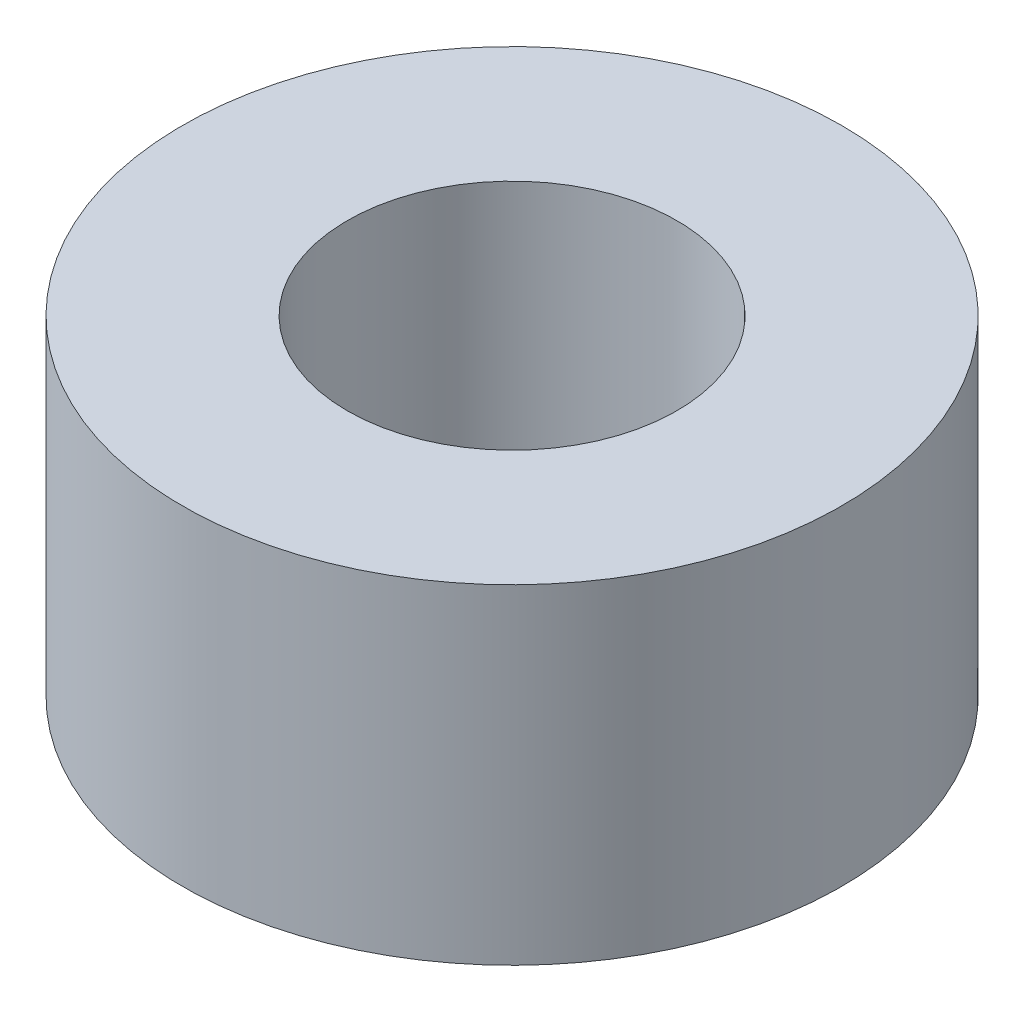
ISO-10303-21;
HEADER;
FILE_DESCRIPTION(('STEP AP214'),'2;1');
FILE_NAME('part.step','',(''),(''),'','','');
FILE_SCHEMA(('AUTOMOTIVE_DESIGN { 1 0 10303 214 1 1 1 1 }'));
ENDSEC;
DATA;
#1=APPLICATION_CONTEXT('core data for automotive mechanical design processes');
#2=APPLICATION_PROTOCOL_DEFINITION('international standard','automotive_design',2000,#1);
#3=PRODUCT_CONTEXT('',#1,'mechanical');
#4=PRODUCT('Part','Part','',(#3));
#5=PRODUCT_RELATED_PRODUCT_CATEGORY('part','',(#4));
#6=PRODUCT_DEFINITION_FORMATION('','',#4);
#7=PRODUCT_DEFINITION_CONTEXT('part definition',#1,'design');
#8=PRODUCT_DEFINITION('design','',#6,#7);
#9=PRODUCT_DEFINITION_SHAPE('','',#8);
#10=(LENGTH_UNIT() NAMED_UNIT(*) SI_UNIT(.MILLI.,.METRE.));
#11=(NAMED_UNIT(*) PLANE_ANGLE_UNIT() SI_UNIT($,.RADIAN.));
#12=(NAMED_UNIT(*) SI_UNIT($,.STERADIAN.) SOLID_ANGLE_UNIT());
#13=UNCERTAINTY_MEASURE_WITH_UNIT(LENGTH_MEASURE(1.E-05),#10,'distance_accuracy_value','');
#14=(GEOMETRIC_REPRESENTATION_CONTEXT(3) GLOBAL_UNCERTAINTY_ASSIGNED_CONTEXT((#13)) GLOBAL_UNIT_ASSIGNED_CONTEXT((#10,
#11,#12)) REPRESENTATION_CONTEXT('',''));
#15=CARTESIAN_POINT('',(0.,0.,0.));
#16=DIRECTION('',(0.,0.,1.));
#17=DIRECTION('',(1.,0.,0.));
#18=AXIS2_PLACEMENT_3D('',#15,#16,#17);
#19=CARTESIAN_POINT('',(32.,-44.175,0.));
#20=DIRECTION('',(0.,1.,0.));
#21=DIRECTION('',(0.,0.,1.));
#22=AXIS2_PLACEMENT_3D('',#19,#20,#21);
#23=CYLINDRICAL_SURFACE('',#22,1.5875);
#24=CARTESIAN_POINT('',(32.,-44.175,0.));
#25=DIRECTION('',(0.,1.,0.));
#26=DIRECTION('',(0.,0.,1.));
#27=AXIS2_PLACEMENT_3D('',#24,#25,#26);
#28=CIRCLE('',#27,1.5875);
#29=CARTESIAN_POINT('',(32.,-44.175,1.5875));
#30=VERTEX_POINT('',#29);
#31=EDGE_CURVE('E23',#30,#30,#28,.T.);
#32=ORIENTED_EDGE('',*,*,#31,.F.);
#33=EDGE_LOOP('',(#32));
#34=FACE_BOUND('',#33,.T.);
#35=CARTESIAN_POINT('',(32.,-41.,0.));
#36=DIRECTION('',(0.,1.,0.));
#37=DIRECTION('',(0.,0.,1.));
#38=AXIS2_PLACEMENT_3D('',#35,#36,#37);
#39=CIRCLE('',#38,1.5875);
#40=CARTESIAN_POINT('',(32.,-41.,1.5875));
#41=VERTEX_POINT('',#40);
#42=EDGE_CURVE('E34',#41,#41,#39,.T.);
#43=ORIENTED_EDGE('',*,*,#42,.T.);
#44=EDGE_LOOP('',(#43));
#45=FACE_BOUND('',#44,.T.);
#46=ADVANCED_FACE('F15',(#34,#45),#23,.F.);
#47=CARTESIAN_POINT('',(32.,-44.175,0.));
#48=DIRECTION('',(0.,1.,0.));
#49=DIRECTION('',(0.,0.,1.));
#50=AXIS2_PLACEMENT_3D('',#47,#48,#49);
#51=CYLINDRICAL_SURFACE('',#50,3.175);
#52=CARTESIAN_POINT('',(32.,-44.175,0.));
#53=DIRECTION('',(0.,-1.,0.));
#54=DIRECTION('',(0.,0.,-1.));
#55=AXIS2_PLACEMENT_3D('',#52,#53,#54);
#56=CIRCLE('',#55,3.175);
#57=CARTESIAN_POINT('',(32.,-44.175,-3.175));
#58=VERTEX_POINT('',#57);
#59=EDGE_CURVE('E10',#58,#58,#56,.T.);
#60=ORIENTED_EDGE('',*,*,#59,.F.);
#61=EDGE_LOOP('',(#60));
#62=FACE_BOUND('',#61,.T.);
#63=CARTESIAN_POINT('',(32.,-41.,0.));
#64=DIRECTION('',(0.,-1.,0.));
#65=DIRECTION('',(0.,0.,-1.));
#66=AXIS2_PLACEMENT_3D('',#63,#64,#65);
#67=CIRCLE('',#66,3.175);
#68=CARTESIAN_POINT('',(32.,-41.,-3.175));
#69=VERTEX_POINT('',#68);
#70=EDGE_CURVE('E18',#69,#69,#67,.T.);
#71=ORIENTED_EDGE('',*,*,#70,.T.);
#72=EDGE_LOOP('',(#71));
#73=FACE_BOUND('',#72,.T.);
#74=ADVANCED_FACE('F44',(#62,#73),#51,.T.);
#75=CARTESIAN_POINT('',(16.,-44.175,0.));
#76=DIRECTION('',(0.,1.,0.));
#77=DIRECTION('',(-1.,0.,0.));
#78=AXIS2_PLACEMENT_3D('',#75,#76,#77);
#79=PLANE('',#78);
#80=ORIENTED_EDGE('',*,*,#31,.T.);
#81=EDGE_LOOP('',(#80));
#82=FACE_BOUND('',#81,.T.);
#83=ORIENTED_EDGE('',*,*,#59,.T.);
#84=EDGE_LOOP('',(#83));
#85=FACE_BOUND('',#84,.T.);
#86=ADVANCED_FACE('F48',(#82,#85),#79,.F.);
#87=CARTESIAN_POINT('',(16.,-41.,0.));
#88=DIRECTION('',(0.,1.,0.));
#89=DIRECTION('',(-1.,0.,0.));
#90=AXIS2_PLACEMENT_3D('',#87,#88,#89);
#91=PLANE('',#90);
#92=ORIENTED_EDGE('',*,*,#42,.F.);
#93=EDGE_LOOP('',(#92));
#94=FACE_BOUND('',#93,.T.);
#95=ORIENTED_EDGE('',*,*,#70,.F.);
#96=EDGE_LOOP('',(#95));
#97=FACE_BOUND('',#96,.T.);
#98=ADVANCED_FACE('F46',(#94,#97),#91,.T.);
#99=CLOSED_SHELL('',(#46,#74,#86,#98));
#100=MANIFOLD_SOLID_BREP('B1',#99);
#101=ADVANCED_BREP_SHAPE_REPRESENTATION('',(#18,#100),#14);
#102=SHAPE_DEFINITION_REPRESENTATION(#9,#101);
ENDSEC;
END-ISO-10303-21;
